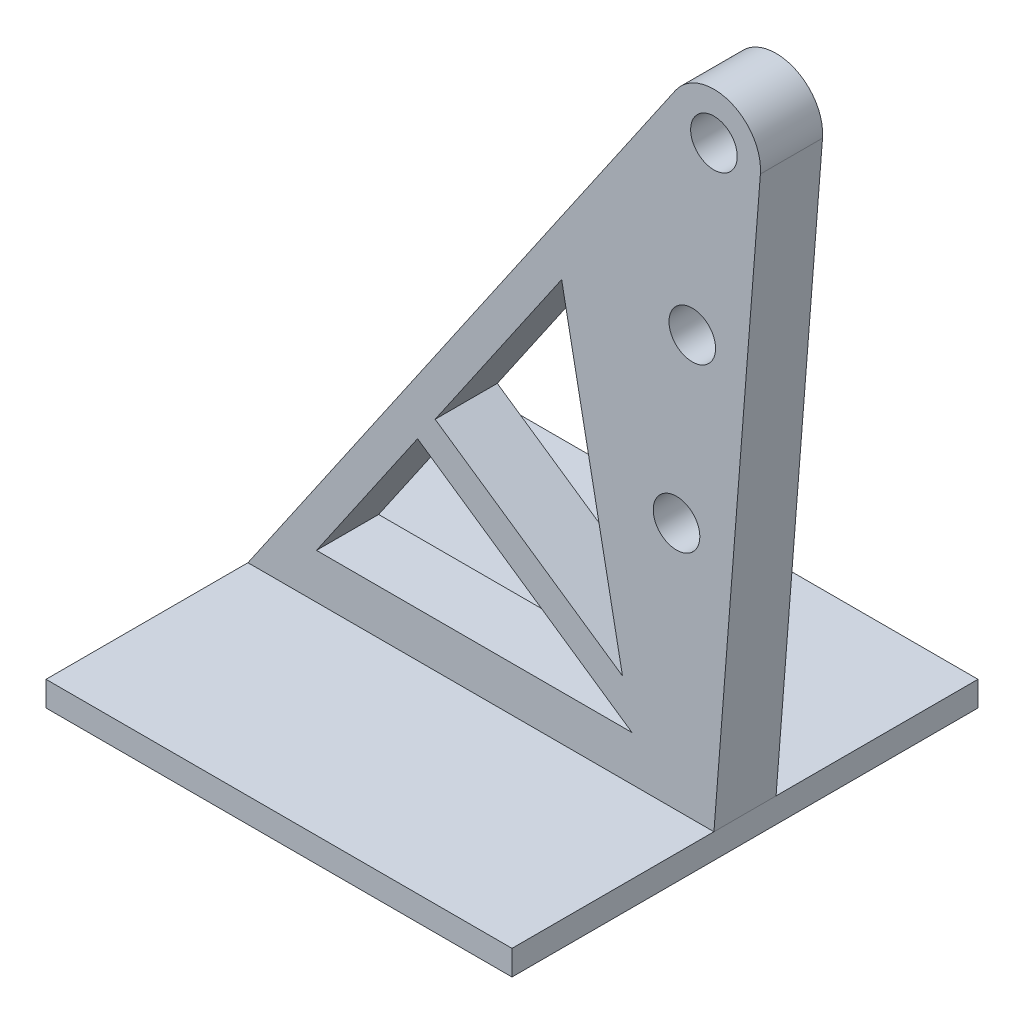
ISO-10303-21;
HEADER;
FILE_DESCRIPTION(('STEP AP214'),'2;1');
FILE_NAME('part.step','',(''),(''),'','','');
FILE_SCHEMA(('AUTOMOTIVE_DESIGN { 1 0 10303 214 1 1 1 1 }'));
ENDSEC;
DATA;
#1=APPLICATION_CONTEXT('core data for automotive mechanical design processes');
#2=APPLICATION_PROTOCOL_DEFINITION('international standard','automotive_design',2000,#1);
#3=PRODUCT_CONTEXT('',#1,'mechanical');
#4=PRODUCT('Part','Part','',(#3));
#5=PRODUCT_RELATED_PRODUCT_CATEGORY('part','',(#4));
#6=PRODUCT_DEFINITION_FORMATION('','',#4);
#7=PRODUCT_DEFINITION_CONTEXT('part definition',#1,'design');
#8=PRODUCT_DEFINITION('design','',#6,#7);
#9=PRODUCT_DEFINITION_SHAPE('','',#8);
#10=(LENGTH_UNIT() NAMED_UNIT(*) SI_UNIT(.MILLI.,.METRE.));
#11=(NAMED_UNIT(*) PLANE_ANGLE_UNIT() SI_UNIT($,.RADIAN.));
#12=(NAMED_UNIT(*) SI_UNIT($,.STERADIAN.) SOLID_ANGLE_UNIT());
#13=UNCERTAINTY_MEASURE_WITH_UNIT(LENGTH_MEASURE(1.E-05),#10,'distance_accuracy_value','');
#14=(GEOMETRIC_REPRESENTATION_CONTEXT(3) GLOBAL_UNCERTAINTY_ASSIGNED_CONTEXT((#13)) GLOBAL_UNIT_ASSIGNED_CONTEXT((#10,
#11,#12)) REPRESENTATION_CONTEXT('',''));
#15=CARTESIAN_POINT('',(0.,0.,0.));
#16=DIRECTION('',(0.,0.,1.));
#17=DIRECTION('',(1.,0.,0.));
#18=AXIS2_PLACEMENT_3D('',#15,#16,#17);
#19=CARTESIAN_POINT('',(0.,0.8,0.));
#20=DIRECTION('',(0.,-1.,0.));
#21=DIRECTION('',(0.,0.,-1.));
#22=AXIS2_PLACEMENT_3D('',#19,#20,#21);
#23=PLANE('',#22);
#24=DIRECTION('',(1.,0.,0.));
#25=VECTOR('',#24,1.);
#26=CARTESIAN_POINT('',(-7.5,0.8,1.));
#27=LINE('',#26,#25);
#28=CARTESIAN_POINT('',(-7.5,0.8,1.));
#29=VERTEX_POINT('',#28);
#30=CARTESIAN_POINT('',(7.5,0.8,1.));
#31=VERTEX_POINT('',#30);
#32=EDGE_CURVE('E211',#29,#31,#27,.T.);
#33=ORIENTED_EDGE('',*,*,#32,.F.);
#34=DIRECTION('',(0.,0.,1.));
#35=VECTOR('',#34,1.);
#36=CARTESIAN_POINT('',(-7.5,0.8,7.5));
#37=LINE('',#36,#35);
#38=CARTESIAN_POINT('',(-7.5,0.8,7.5));
#39=VERTEX_POINT('',#38);
#40=EDGE_CURVE('E260',#29,#39,#37,.T.);
#41=ORIENTED_EDGE('',*,*,#40,.T.);
#42=DIRECTION('',(1.,0.,0.));
#43=VECTOR('',#42,1.);
#44=CARTESIAN_POINT('',(-7.5,0.8,7.5));
#45=LINE('',#44,#43);
#46=CARTESIAN_POINT('',(7.5,0.8,7.5));
#47=VERTEX_POINT('',#46);
#48=EDGE_CURVE('E265',#39,#47,#45,.T.);
#49=ORIENTED_EDGE('',*,*,#48,.T.);
#50=DIRECTION('',(0.,0.,-1.));
#51=VECTOR('',#50,1.);
#52=CARTESIAN_POINT('',(7.5,0.8,7.5));
#53=LINE('',#52,#51);
#54=EDGE_CURVE('E253',#47,#31,#53,.T.);
#55=ORIENTED_EDGE('',*,*,#54,.T.);
#56=EDGE_LOOP('',(#33,#41,#49,#55));
#57=FACE_BOUND('',#56,.T.);
#58=ADVANCED_FACE('F39',(#57),#23,.F.);
#59=CARTESIAN_POINT('',(7.5,0.8,7.5));
#60=DIRECTION('',(-1.,0.,0.));
#61=DIRECTION('',(0.,0.,1.));
#62=AXIS2_PLACEMENT_3D('',#59,#60,#61);
#63=PLANE('',#62);
#64=DIRECTION('',(0.,0.,-1.));
#65=VECTOR('',#64,1.);
#66=CARTESIAN_POINT('',(7.5,0.,7.5));
#67=LINE('',#66,#65);
#68=CARTESIAN_POINT('',(7.5,0.,7.5));
#69=VERTEX_POINT('',#68);
#70=CARTESIAN_POINT('',(7.5,0.,-7.5));
#71=VERTEX_POINT('',#70);
#72=EDGE_CURVE('E252',#69,#71,#67,.T.);
#73=ORIENTED_EDGE('',*,*,#72,.T.);
#74=DIRECTION('',(0.,-1.,0.));
#75=VECTOR('',#74,1.);
#76=CARTESIAN_POINT('',(7.5,0.8,-7.5));
#77=LINE('',#76,#75);
#78=CARTESIAN_POINT('',(7.5,0.8,-7.5));
#79=VERTEX_POINT('',#78);
#80=EDGE_CURVE('E292',#79,#71,#77,.T.);
#81=ORIENTED_EDGE('',*,*,#80,.F.);
#82=CARTESIAN_POINT('',(7.5,0.8,-1.));
#83=VERTEX_POINT('',#82);
#84=EDGE_CURVE('E257',#83,#79,#53,.T.);
#85=ORIENTED_EDGE('',*,*,#84,.F.);
#86=DIRECTION('',(0.,0.,-1.));
#87=VECTOR('',#86,1.);
#88=CARTESIAN_POINT('',(7.5,0.8,1.));
#89=LINE('',#88,#87);
#90=EDGE_CURVE('E248',#31,#83,#89,.T.);
#91=ORIENTED_EDGE('',*,*,#90,.F.);
#92=ORIENTED_EDGE('',*,*,#54,.F.);
#93=DIRECTION('',(0.,-1.,0.));
#94=VECTOR('',#93,1.);
#95=CARTESIAN_POINT('',(7.5,0.8,7.5));
#96=LINE('',#95,#94);
#97=EDGE_CURVE('E268',#47,#69,#96,.T.);
#98=ORIENTED_EDGE('',*,*,#97,.T.);
#99=EDGE_LOOP('',(#73,#81,#85,#91,#92,#98));
#100=FACE_BOUND('',#99,.T.);
#101=ADVANCED_FACE('F41',(#100),#63,.F.);
#102=CARTESIAN_POINT('',(-7.5,0.8,-7.5));
#103=DIRECTION('',(0.,0.,1.));
#104=DIRECTION('',(1.,0.,0.));
#105=AXIS2_PLACEMENT_3D('',#102,#103,#104);
#106=PLANE('',#105);
#107=DIRECTION('',(-1.,0.,0.));
#108=VECTOR('',#107,1.);
#109=CARTESIAN_POINT('',(-7.5,0.,-7.5));
#110=LINE('',#109,#108);
#111=CARTESIAN_POINT('',(-7.5,0.,-7.5));
#112=VERTEX_POINT('',#111);
#113=EDGE_CURVE('E272',#71,#112,#110,.T.);
#114=ORIENTED_EDGE('',*,*,#113,.T.);
#115=DIRECTION('',(0.,-1.,0.));
#116=VECTOR('',#115,1.);
#117=CARTESIAN_POINT('',(-7.5,0.8,-7.5));
#118=LINE('',#117,#116);
#119=CARTESIAN_POINT('',(-7.5,0.8,-7.5));
#120=VERTEX_POINT('',#119);
#121=EDGE_CURVE('E288',#120,#112,#118,.T.);
#122=ORIENTED_EDGE('',*,*,#121,.F.);
#123=DIRECTION('',(-1.,0.,0.));
#124=VECTOR('',#123,1.);
#125=CARTESIAN_POINT('',(-7.5,0.8,-7.5));
#126=LINE('',#125,#124);
#127=EDGE_CURVE('E256',#79,#120,#126,.T.);
#128=ORIENTED_EDGE('',*,*,#127,.F.);
#129=ORIENTED_EDGE('',*,*,#80,.T.);
#130=EDGE_LOOP('',(#114,#122,#128,#129));
#131=FACE_BOUND('',#130,.T.);
#132=ADVANCED_FACE('F350',(#131),#106,.F.);
#133=CARTESIAN_POINT('',(-7.5,0.8,7.5));
#134=DIRECTION('',(1.,0.,0.));
#135=DIRECTION('',(0.,0.,-1.));
#136=AXIS2_PLACEMENT_3D('',#133,#134,#135);
#137=PLANE('',#136);
#138=DIRECTION('',(0.,0.,1.));
#139=VECTOR('',#138,1.);
#140=CARTESIAN_POINT('',(-7.5,0.,7.5));
#141=LINE('',#140,#139);
#142=CARTESIAN_POINT('',(-7.5,0.,7.5));
#143=VERTEX_POINT('',#142);
#144=EDGE_CURVE('E275',#112,#143,#141,.T.);
#145=ORIENTED_EDGE('',*,*,#144,.T.);
#146=DIRECTION('',(0.,-1.,0.));
#147=VECTOR('',#146,1.);
#148=CARTESIAN_POINT('',(-7.5,0.8,7.5));
#149=LINE('',#148,#147);
#150=EDGE_CURVE('E284',#39,#143,#149,.T.);
#151=ORIENTED_EDGE('',*,*,#150,.F.);
#152=ORIENTED_EDGE('',*,*,#40,.F.);
#153=DIRECTION('',(0.,0.,-1.));
#154=VECTOR('',#153,1.);
#155=CARTESIAN_POINT('',(-7.5,0.8,1.));
#156=LINE('',#155,#154);
#157=CARTESIAN_POINT('',(-7.5,0.8,-1.));
#158=VERTEX_POINT('',#157);
#159=EDGE_CURVE('E226',#29,#158,#156,.T.);
#160=ORIENTED_EDGE('',*,*,#159,.T.);
#161=EDGE_CURVE('E261',#120,#158,#37,.T.);
#162=ORIENTED_EDGE('',*,*,#161,.F.);
#163=ORIENTED_EDGE('',*,*,#121,.T.);
#164=EDGE_LOOP('',(#145,#151,#152,#160,#162,#163));
#165=FACE_BOUND('',#164,.T.);
#166=ADVANCED_FACE('F364',(#165),#137,.F.);
#167=CARTESIAN_POINT('',(-7.5,0.8,7.5));
#168=DIRECTION('',(0.,0.,-1.));
#169=DIRECTION('',(-1.,0.,0.));
#170=AXIS2_PLACEMENT_3D('',#167,#168,#169);
#171=PLANE('',#170);
#172=DIRECTION('',(1.,0.,0.));
#173=VECTOR('',#172,1.);
#174=CARTESIAN_POINT('',(-7.5,0.,7.5));
#175=LINE('',#174,#173);
#176=EDGE_CURVE('E278',#143,#69,#175,.T.);
#177=ORIENTED_EDGE('',*,*,#176,.T.);
#178=ORIENTED_EDGE('',*,*,#97,.F.);
#179=ORIENTED_EDGE('',*,*,#48,.F.);
#180=ORIENTED_EDGE('',*,*,#150,.T.);
#181=EDGE_LOOP('',(#177,#178,#179,#180));
#182=FACE_BOUND('',#181,.T.);
#183=ADVANCED_FACE('F356',(#182),#171,.F.);
#184=ORIENTED_EDGE('',*,*,#161,.T.);
#185=DIRECTION('',(1.,0.,0.));
#186=VECTOR('',#185,1.);
#187=CARTESIAN_POINT('',(-7.5,0.8,-1.));
#188=LINE('',#187,#186);
#189=EDGE_CURVE('E210',#158,#83,#188,.T.);
#190=ORIENTED_EDGE('',*,*,#189,.T.);
#191=ORIENTED_EDGE('',*,*,#84,.T.);
#192=ORIENTED_EDGE('',*,*,#127,.T.);
#193=EDGE_LOOP('',(#184,#190,#191,#192));
#194=FACE_BOUND('',#193,.T.);
#195=ADVANCED_FACE('F346',(#194),#23,.F.);
#196=CARTESIAN_POINT('',(0.,0.,0.));
#197=DIRECTION('',(0.,-1.,0.));
#198=DIRECTION('',(0.,0.,-1.));
#199=AXIS2_PLACEMENT_3D('',#196,#197,#198);
#200=PLANE('',#199);
#201=ORIENTED_EDGE('',*,*,#72,.F.);
#202=ORIENTED_EDGE('',*,*,#176,.F.);
#203=ORIENTED_EDGE('',*,*,#144,.F.);
#204=ORIENTED_EDGE('',*,*,#113,.F.);
#205=EDGE_LOOP('',(#201,#202,#203,#204));
#206=FACE_BOUND('',#205,.T.);
#207=ADVANCED_FACE('F355',(#206),#200,.T.);
#208=CARTESIAN_POINT('',(7.5,0.8,1.));
#209=DIRECTION('',(-0.996943571309329,0.078125,0.));
#210=DIRECTION('',(-0.078125,-0.996943571309329,0.));
#211=AXIS2_PLACEMENT_3D('',#208,#209,#210);
#212=PLANE('',#211);
#213=DIRECTION('',(0.078125,0.996943571309329,0.));
#214=VECTOR('',#213,1.);
#215=CARTESIAN_POINT('',(7.5,0.8,-1.));
#216=LINE('',#215,#214);
#217=CARTESIAN_POINT('',(8.99541535696399,19.8828125,-1.));
#218=VERTEX_POINT('',#217);
#219=EDGE_CURVE('E229',#83,#218,#216,.T.);
#220=ORIENTED_EDGE('',*,*,#219,.T.);
#221=DIRECTION('',(0.,0.,-1.));
#222=VECTOR('',#221,1.);
#223=CARTESIAN_POINT('',(8.99541535696399,19.8828125,1.));
#224=LINE('',#223,#222);
#225=CARTESIAN_POINT('',(8.99541535696399,19.8828125,1.));
#226=VERTEX_POINT('',#225);
#227=EDGE_CURVE('E244',#226,#218,#224,.T.);
#228=ORIENTED_EDGE('',*,*,#227,.F.);
#229=DIRECTION('',(0.078125,0.996943571309329,0.));
#230=VECTOR('',#229,1.);
#231=CARTESIAN_POINT('',(7.5,0.8,1.));
#232=LINE('',#231,#230);
#233=EDGE_CURVE('E215',#31,#226,#232,.T.);
#234=ORIENTED_EDGE('',*,*,#233,.F.);
#235=ORIENTED_EDGE('',*,*,#90,.T.);
#236=EDGE_LOOP('',(#220,#228,#234,#235));
#237=FACE_BOUND('',#236,.T.);
#238=ADVANCED_FACE('F362',(#237),#212,.F.);
#239=CARTESIAN_POINT('',(7.5,20.,1.));
#240=DIRECTION('',(0.,0.,-1.));
#241=DIRECTION('',(-1.,0.,0.));
#242=AXIS2_PLACEMENT_3D('',#239,#240,#241);
#243=CYLINDRICAL_SURFACE('',#242,1.5);
#244=CARTESIAN_POINT('',(7.5,20.,-1.));
#245=DIRECTION('',(0.,0.,1.));
#246=DIRECTION('',(1.,0.,0.));
#247=AXIS2_PLACEMENT_3D('',#244,#245,#246);
#248=CIRCLE('',#247,1.5);
#249=CARTESIAN_POINT('',(6.26335299126237,20.8489429755763,-1.));
#250=VERTEX_POINT('',#249);
#251=EDGE_CURVE('E232',#218,#250,#248,.T.);
#252=ORIENTED_EDGE('',*,*,#251,.T.);
#253=DIRECTION('',(0.,0.,-1.));
#254=VECTOR('',#253,1.);
#255=CARTESIAN_POINT('',(6.26335299126237,20.8489429755763,1.));
#256=LINE('',#255,#254);
#257=CARTESIAN_POINT('',(6.26335299126237,20.8489429755763,1.));
#258=VERTEX_POINT('',#257);
#259=EDGE_CURVE('E241',#258,#250,#256,.T.);
#260=ORIENTED_EDGE('',*,*,#259,.F.);
#261=CARTESIAN_POINT('',(7.5,20.,1.));
#262=DIRECTION('',(0.,0.,1.));
#263=DIRECTION('',(1.,0.,0.));
#264=AXIS2_PLACEMENT_3D('',#261,#262,#263);
#265=CIRCLE('',#264,1.5);
#266=EDGE_CURVE('E219',#226,#258,#265,.T.);
#267=ORIENTED_EDGE('',*,*,#266,.F.);
#268=ORIENTED_EDGE('',*,*,#227,.T.);
#269=EDGE_LOOP('',(#252,#260,#267,#268));
#270=FACE_BOUND('',#269,.T.);
#271=ADVANCED_FACE('F338',(#270),#243,.T.);
#272=CARTESIAN_POINT('',(-7.5,0.8,1.));
#273=DIRECTION('',(-0.824431339158416,0.565961983717512,0.));
#274=DIRECTION('',(-0.565961983717512,-0.824431339158416,0.));
#275=AXIS2_PLACEMENT_3D('',#272,#273,#274);
#276=PLANE('',#275);
#277=DIRECTION('',(0.565961983717512,0.824431339158416,0.));
#278=VECTOR('',#277,1.);
#279=CARTESIAN_POINT('',(-7.5,0.8,-1.));
#280=LINE('',#279,#278);
#281=EDGE_CURVE('E216',#158,#250,#280,.T.);
#282=ORIENTED_EDGE('',*,*,#281,.F.);
#283=ORIENTED_EDGE('',*,*,#159,.F.);
#284=DIRECTION('',(0.565961983717512,0.824431339158416,0.));
#285=VECTOR('',#284,1.);
#286=CARTESIAN_POINT('',(-7.5,0.8,1.));
#287=LINE('',#286,#285);
#288=EDGE_CURVE('E222',#29,#258,#287,.T.);
#289=ORIENTED_EDGE('',*,*,#288,.T.);
#290=ORIENTED_EDGE('',*,*,#259,.T.);
#291=EDGE_LOOP('',(#282,#283,#289,#290));
#292=FACE_BOUND('',#291,.T.);
#293=ADVANCED_FACE('F328',(#292),#276,.T.);
#294=CARTESIAN_POINT('',(7.5,20.,1.));
#295=DIRECTION('',(0.,0.,1.));
#296=DIRECTION('',(1.,0.,0.));
#297=AXIS2_PLACEMENT_3D('',#294,#295,#296);
#298=PLANE('',#297);
#299=CARTESIAN_POINT('',(6.295860940672,8.8,1.));
#300=DIRECTION('',(0.,0.,1.));
#301=DIRECTION('',(1.,0.,0.));
#302=AXIS2_PLACEMENT_3D('',#299,#300,#301);
#303=CIRCLE('',#302,0.75);
#304=CARTESIAN_POINT('',(7.045860940672,8.8,1.));
#305=VERTEX_POINT('',#304);
#306=EDGE_CURVE('E174',#305,#305,#303,.T.);
#307=ORIENTED_EDGE('',*,*,#306,.F.);
#308=EDGE_LOOP('',(#307));
#309=FACE_BOUND('',#308,.T.);
#310=DIRECTION('',(-0.824431339158416,0.565961983717512,0.));
#311=VECTOR('',#310,1.);
#312=CARTESIAN_POINT('',(4.86387780825259,2.24733533897935,1.));
#313=LINE('',#312,#311);
#314=CARTESIAN_POINT('',(4.86387780825259,2.24733533897935,1.));
#315=VERTEX_POINT('',#314);
#316=CARTESIAN_POINT('',(-2.03993624416734,6.98671885187808,1.));
#317=VERTEX_POINT('',#316);
#318=EDGE_CURVE('E56',#315,#317,#313,.T.);
#319=ORIENTED_EDGE('',*,*,#318,.F.);
#320=DIRECTION('',(1.,0.,0.));
#321=VECTOR('',#320,1.);
#322=CARTESIAN_POINT('',(-5.29346478821366,2.24733533897935,1.));
#323=LINE('',#322,#321);
#324=CARTESIAN_POINT('',(-5.29346478821366,2.24733533897935,1.));
#325=VERTEX_POINT('',#324);
#326=EDGE_CURVE('E186',#325,#315,#323,.T.);
#327=ORIENTED_EDGE('',*,*,#326,.F.);
#328=DIRECTION('',(-0.565961983717512,-0.824431339158416,0.));
#329=VECTOR('',#328,1.);
#330=CARTESIAN_POINT('',(-2.03993624416734,6.98671885187808,1.));
#331=LINE('',#330,#329);
#332=EDGE_CURVE('E182',#317,#325,#331,.T.);
#333=ORIENTED_EDGE('',*,*,#332,.F.);
#334=EDGE_LOOP('',(#319,#327,#333));
#335=FACE_BOUND('',#334,.T.);
#336=DIRECTION('',(-0.565961983717512,-0.824431339158416,0.));
#337=VECTOR('',#336,1.);
#338=CARTESIAN_POINT('',(2.59799305155808,13.7427455289375,1.));
#339=LINE('',#338,#337);
#340=CARTESIAN_POINT('',(2.59799305155808,13.7427455289375,1.));
#341=VERTEX_POINT('',#340);
#342=CARTESIAN_POINT('',(-1.47397426044983,7.8111501910365,1.));
#343=VERTEX_POINT('',#342);
#344=EDGE_CURVE('E64',#341,#343,#339,.T.);
#345=ORIENTED_EDGE('',*,*,#344,.F.);
#346=DIRECTION('',(-0.190874155677059,0.981614515323897,0.));
#347=VECTOR('',#346,1.);
#348=CARTESIAN_POINT('',(4.55635786666214,3.67140128651319,1.));
#349=LINE('',#348,#347);
#350=CARTESIAN_POINT('',(4.55635786666214,3.67140128651319,1.));
#351=VERTEX_POINT('',#350);
#352=EDGE_CURVE('E149',#351,#341,#349,.T.);
#353=ORIENTED_EDGE('',*,*,#352,.F.);
#354=DIRECTION('',(0.824431339158416,-0.565961983717512,0.));
#355=VECTOR('',#354,1.);
#356=CARTESIAN_POINT('',(-1.47397426044983,7.81115019103649,1.));
#357=LINE('',#356,#355);
#358=EDGE_CURVE('E159',#343,#351,#357,.T.);
#359=ORIENTED_EDGE('',*,*,#358,.F.);
#360=EDGE_LOOP('',(#345,#353,#359));
#361=FACE_BOUND('',#360,.T.);
#362=CARTESIAN_POINT('',(6.80335890635377,14.3,1.));
#363=DIRECTION('',(0.,0.,1.));
#364=DIRECTION('',(1.,0.,0.));
#365=AXIS2_PLACEMENT_3D('',#362,#363,#364);
#366=CIRCLE('',#365,0.75);
#367=CARTESIAN_POINT('',(7.55335890635377,14.3,1.));
#368=VERTEX_POINT('',#367);
#369=EDGE_CURVE('E178',#368,#368,#366,.T.);
#370=ORIENTED_EDGE('',*,*,#369,.F.);
#371=EDGE_LOOP('',(#370));
#372=FACE_BOUND('',#371,.T.);
#373=CARTESIAN_POINT('',(7.5,20.,1.));
#374=DIRECTION('',(0.,0.,1.));
#375=DIRECTION('',(1.,0.,0.));
#376=AXIS2_PLACEMENT_3D('',#373,#374,#375);
#377=CIRCLE('',#376,0.75);
#378=CARTESIAN_POINT('',(8.25,20.,1.));
#379=VERTEX_POINT('',#378);
#380=EDGE_CURVE('E206',#379,#379,#377,.T.);
#381=ORIENTED_EDGE('',*,*,#380,.F.);
#382=EDGE_LOOP('',(#381));
#383=FACE_BOUND('',#382,.T.);
#384=ORIENTED_EDGE('',*,*,#32,.T.);
#385=ORIENTED_EDGE('',*,*,#233,.T.);
#386=ORIENTED_EDGE('',*,*,#266,.T.);
#387=ORIENTED_EDGE('',*,*,#288,.F.);
#388=EDGE_LOOP('',(#384,#385,#386,#387));
#389=FACE_BOUND('',#388,.T.);
#390=ADVANCED_FACE('F164',(#309,#335,#361,#372,#383,#389),#298,.T.);
#391=CARTESIAN_POINT('',(7.5,20.,-1.));
#392=DIRECTION('',(0.,0.,1.));
#393=DIRECTION('',(1.,0.,0.));
#394=AXIS2_PLACEMENT_3D('',#391,#392,#393);
#395=PLANE('',#394);
#396=CARTESIAN_POINT('',(6.295860940672,8.8,-1.));
#397=DIRECTION('',(0.,0.,1.));
#398=DIRECTION('',(1.,0.,0.));
#399=AXIS2_PLACEMENT_3D('',#396,#397,#398);
#400=CIRCLE('',#399,0.75);
#401=CARTESIAN_POINT('',(7.045860940672,8.8,-1.));
#402=VERTEX_POINT('',#401);
#403=EDGE_CURVE('E43',#402,#402,#400,.T.);
#404=ORIENTED_EDGE('',*,*,#403,.T.);
#405=EDGE_LOOP('',(#404));
#406=FACE_BOUND('',#405,.T.);
#407=DIRECTION('',(1.,0.,0.));
#408=VECTOR('',#407,1.);
#409=CARTESIAN_POINT('',(7.5,2.24733533897934,-1.));
#410=LINE('',#409,#408);
#411=CARTESIAN_POINT('',(-5.29346478821366,2.24733533897935,-1.));
#412=VERTEX_POINT('',#411);
#413=CARTESIAN_POINT('',(4.86387780825259,2.24733533897935,-1.));
#414=VERTEX_POINT('',#413);
#415=EDGE_CURVE('E49',#412,#414,#410,.T.);
#416=ORIENTED_EDGE('',*,*,#415,.T.);
#417=DIRECTION('',(-0.824431339158416,0.565961983717512,0.));
#418=VECTOR('',#417,1.);
#419=CARTESIAN_POINT('',(-1.62772057458813,6.70373786001932,-1.));
#420=LINE('',#419,#418);
#421=CARTESIAN_POINT('',(-2.03993624416734,6.98671885187808,-1.));
#422=VERTEX_POINT('',#421);
#423=EDGE_CURVE('E11',#414,#422,#420,.T.);
#424=ORIENTED_EDGE('',*,*,#423,.T.);
#425=DIRECTION('',(-0.565961983717512,-0.824431339158416,0.));
#426=VECTOR('',#425,1.);
#427=CARTESIAN_POINT('',(7.08778433042079,20.2829809918588,-1.));
#428=LINE('',#427,#426);
#429=EDGE_CURVE('E308',#422,#412,#428,.T.);
#430=ORIENTED_EDGE('',*,*,#429,.T.);
#431=EDGE_LOOP('',(#416,#424,#430));
#432=FACE_BOUND('',#431,.T.);
#433=DIRECTION('',(-0.190874155677059,0.981614515323897,0.));
#434=VECTOR('',#433,1.);
#435=CARTESIAN_POINT('',(1.60419809864045,18.8535660461481,-1.));
#436=LINE('',#435,#434);
#437=CARTESIAN_POINT('',(4.55635786666214,3.67140128651319,-1.));
#438=VERTEX_POINT('',#437);
#439=CARTESIAN_POINT('',(2.59799305155808,13.7427455289375,-1.));
#440=VERTEX_POINT('',#439);
#441=EDGE_CURVE('E151',#438,#440,#436,.T.);
#442=ORIENTED_EDGE('',*,*,#441,.T.);
#443=DIRECTION('',(-0.565961983717512,-0.824431339158416,0.));
#444=VECTOR('',#443,1.);
#445=CARTESIAN_POINT('',(7.08778433042079,20.2829809918588,-1.));
#446=LINE('',#445,#444);
#447=CARTESIAN_POINT('',(-1.47397426044983,7.81115019103649,-1.));
#448=VERTEX_POINT('',#447);
#449=EDGE_CURVE('E304',#440,#448,#446,.T.);
#450=ORIENTED_EDGE('',*,*,#449,.T.);
#451=DIRECTION('',(0.824431339158416,-0.565961983717512,0.));
#452=VECTOR('',#451,1.);
#453=CARTESIAN_POINT('',(-1.06175859087062,7.52816919917774,-1.));
#454=LINE('',#453,#452);
#455=EDGE_CURVE('E296',#448,#438,#454,.T.);
#456=ORIENTED_EDGE('',*,*,#455,.T.);
#457=EDGE_LOOP('',(#442,#450,#456));
#458=FACE_BOUND('',#457,.T.);
#459=CARTESIAN_POINT('',(6.80335890635377,14.3,-1.));
#460=DIRECTION('',(0.,0.,1.));
#461=DIRECTION('',(1.,0.,0.));
#462=AXIS2_PLACEMENT_3D('',#459,#460,#461);
#463=CIRCLE('',#462,0.75);
#464=CARTESIAN_POINT('',(7.55335890635377,14.3,-1.));
#465=VERTEX_POINT('',#464);
#466=EDGE_CURVE('E201',#465,#465,#463,.T.);
#467=ORIENTED_EDGE('',*,*,#466,.T.);
#468=EDGE_LOOP('',(#467));
#469=FACE_BOUND('',#468,.T.);
#470=CARTESIAN_POINT('',(7.5,20.,-1.));
#471=DIRECTION('',(0.,0.,-1.));
#472=DIRECTION('',(-1.,0.,0.));
#473=AXIS2_PLACEMENT_3D('',#470,#471,#472);
#474=CIRCLE('',#473,0.75);
#475=CARTESIAN_POINT('',(6.75,20.,-1.));
#476=VERTEX_POINT('',#475);
#477=EDGE_CURVE('E202',#476,#476,#474,.T.);
#478=ORIENTED_EDGE('',*,*,#477,.F.);
#479=EDGE_LOOP('',(#478));
#480=FACE_BOUND('',#479,.T.);
#481=ORIENTED_EDGE('',*,*,#189,.F.);
#482=ORIENTED_EDGE('',*,*,#281,.T.);
#483=ORIENTED_EDGE('',*,*,#251,.F.);
#484=ORIENTED_EDGE('',*,*,#219,.F.);
#485=EDGE_LOOP('',(#481,#482,#483,#484));
#486=FACE_BOUND('',#485,.T.);
#487=ADVANCED_FACE('F316',(#406,#432,#458,#469,#480,#486),#395,.F.);
#488=CARTESIAN_POINT('',(7.5,20.,7.5));
#489=DIRECTION('',(0.,0.,-1.));
#490=DIRECTION('',(-1.,0.,0.));
#491=AXIS2_PLACEMENT_3D('',#488,#489,#490);
#492=CYLINDRICAL_SURFACE('',#491,0.75);
#493=ORIENTED_EDGE('',*,*,#380,.T.);
#494=EDGE_LOOP('',(#493));
#495=FACE_BOUND('',#494,.T.);
#496=ORIENTED_EDGE('',*,*,#477,.T.);
#497=EDGE_LOOP('',(#496));
#498=FACE_BOUND('',#497,.T.);
#499=ADVANCED_FACE('F335',(#495,#498),#492,.F.);
#500=CARTESIAN_POINT('',(6.80335890635377,14.3,-69.));
#501=DIRECTION('',(0.,0.,1.));
#502=DIRECTION('',(1.,0.,0.));
#503=AXIS2_PLACEMENT_3D('',#500,#501,#502);
#504=CYLINDRICAL_SURFACE('',#503,0.75);
#505=ORIENTED_EDGE('',*,*,#369,.T.);
#506=EDGE_LOOP('',(#505));
#507=FACE_BOUND('',#506,.T.);
#508=ORIENTED_EDGE('',*,*,#466,.F.);
#509=EDGE_LOOP('',(#508));
#510=FACE_BOUND('',#509,.T.);
#511=ADVANCED_FACE('F409',(#507,#510),#504,.F.);
#512=CARTESIAN_POINT('',(2.59799305155808,13.7427455289375,-69.));
#513=DIRECTION('',(-0.824431339158416,0.565961983717512,0.));
#514=DIRECTION('',(-0.565961983717512,-0.824431339158416,0.));
#515=AXIS2_PLACEMENT_3D('',#512,#513,#514);
#516=PLANE('',#515);
#517=DIRECTION('',(0.,0.,1.));
#518=VECTOR('',#517,1.);
#519=CARTESIAN_POINT('',(2.59799305155808,13.7427455289375,-69.));
#520=LINE('',#519,#518);
#521=EDGE_CURVE('E155',#440,#341,#520,.T.);
#522=ORIENTED_EDGE('',*,*,#521,.T.);
#523=ORIENTED_EDGE('',*,*,#344,.T.);
#524=DIRECTION('',(0.,0.,1.));
#525=VECTOR('',#524,1.);
#526=CARTESIAN_POINT('',(-1.47397426044983,7.81115019103649,-69.));
#527=LINE('',#526,#525);
#528=EDGE_CURVE('E156',#448,#343,#527,.T.);
#529=ORIENTED_EDGE('',*,*,#528,.F.);
#530=ORIENTED_EDGE('',*,*,#449,.F.);
#531=EDGE_LOOP('',(#522,#523,#529,#530));
#532=FACE_BOUND('',#531,.T.);
#533=ADVANCED_FACE('F403',(#532),#516,.F.);
#534=CARTESIAN_POINT('',(4.55635786666214,3.67140128651319,-69.));
#535=DIRECTION('',(0.981614515323897,0.190874155677059,0.));
#536=DIRECTION('',(-0.190874155677059,0.981614515323897,0.));
#537=AXIS2_PLACEMENT_3D('',#534,#535,#536);
#538=PLANE('',#537);
#539=DIRECTION('',(0.,0.,1.));
#540=VECTOR('',#539,1.);
#541=CARTESIAN_POINT('',(4.55635786666214,3.67140128651319,-69.));
#542=LINE('',#541,#540);
#543=EDGE_CURVE('E144',#438,#351,#542,.T.);
#544=ORIENTED_EDGE('',*,*,#543,.T.);
#545=ORIENTED_EDGE('',*,*,#352,.T.);
#546=ORIENTED_EDGE('',*,*,#521,.F.);
#547=ORIENTED_EDGE('',*,*,#441,.F.);
#548=EDGE_LOOP('',(#544,#545,#546,#547));
#549=FACE_BOUND('',#548,.T.);
#550=ADVANCED_FACE('F146',(#549),#538,.F.);
#551=CARTESIAN_POINT('',(-1.47397426044983,7.81115019103649,-69.));
#552=DIRECTION('',(-0.565961983717512,-0.824431339158416,0.));
#553=DIRECTION('',(0.824431339158416,-0.565961983717512,0.));
#554=AXIS2_PLACEMENT_3D('',#551,#552,#553);
#555=PLANE('',#554);
#556=ORIENTED_EDGE('',*,*,#528,.T.);
#557=ORIENTED_EDGE('',*,*,#358,.T.);
#558=ORIENTED_EDGE('',*,*,#543,.F.);
#559=ORIENTED_EDGE('',*,*,#455,.F.);
#560=EDGE_LOOP('',(#556,#557,#558,#559));
#561=FACE_BOUND('',#560,.T.);
#562=ADVANCED_FACE('F160',(#561),#555,.F.);
#563=CARTESIAN_POINT('',(4.86387780825259,2.24733533897935,-69.));
#564=DIRECTION('',(0.565961983717512,0.824431339158416,0.));
#565=DIRECTION('',(-0.824431339158416,0.565961983717512,0.));
#566=AXIS2_PLACEMENT_3D('',#563,#564,#565);
#567=PLANE('',#566);
#568=DIRECTION('',(0.,0.,1.));
#569=VECTOR('',#568,1.);
#570=CARTESIAN_POINT('',(4.86387780825259,2.24733533897935,-69.));
#571=LINE('',#570,#569);
#572=EDGE_CURVE('E179',#414,#315,#571,.T.);
#573=ORIENTED_EDGE('',*,*,#572,.T.);
#574=ORIENTED_EDGE('',*,*,#318,.T.);
#575=DIRECTION('',(0.,0.,1.));
#576=VECTOR('',#575,1.);
#577=CARTESIAN_POINT('',(-2.03993624416734,6.98671885187808,-69.));
#578=LINE('',#577,#576);
#579=EDGE_CURVE('E190',#422,#317,#578,.T.);
#580=ORIENTED_EDGE('',*,*,#579,.F.);
#581=ORIENTED_EDGE('',*,*,#423,.F.);
#582=EDGE_LOOP('',(#573,#574,#580,#581));
#583=FACE_BOUND('',#582,.T.);
#584=ADVANCED_FACE('F322',(#583),#567,.F.);
#585=CARTESIAN_POINT('',(-5.29346478821366,2.24733533897935,-69.));
#586=DIRECTION('',(0.,-1.,0.));
#587=DIRECTION('',(0.,0.,-1.));
#588=AXIS2_PLACEMENT_3D('',#585,#586,#587);
#589=PLANE('',#588);
#590=DIRECTION('',(0.,0.,1.));
#591=VECTOR('',#590,1.);
#592=CARTESIAN_POINT('',(-5.29346478821366,2.24733533897935,-69.));
#593=LINE('',#592,#591);
#594=EDGE_CURVE('E193',#412,#325,#593,.T.);
#595=ORIENTED_EDGE('',*,*,#594,.T.);
#596=ORIENTED_EDGE('',*,*,#326,.T.);
#597=ORIENTED_EDGE('',*,*,#572,.F.);
#598=ORIENTED_EDGE('',*,*,#415,.F.);
#599=EDGE_LOOP('',(#595,#596,#597,#598));
#600=FACE_BOUND('',#599,.T.);
#601=ADVANCED_FACE('F320',(#600),#589,.F.);
#602=CARTESIAN_POINT('',(-2.03993624416734,6.98671885187808,-69.));
#603=DIRECTION('',(-0.824431339158416,0.565961983717512,0.));
#604=DIRECTION('',(-0.565961983717512,-0.824431339158416,0.));
#605=AXIS2_PLACEMENT_3D('',#602,#603,#604);
#606=PLANE('',#605);
#607=ORIENTED_EDGE('',*,*,#579,.T.);
#608=ORIENTED_EDGE('',*,*,#332,.T.);
#609=ORIENTED_EDGE('',*,*,#594,.F.);
#610=ORIENTED_EDGE('',*,*,#429,.F.);
#611=EDGE_LOOP('',(#607,#608,#609,#610));
#612=FACE_BOUND('',#611,.T.);
#613=ADVANCED_FACE('F325',(#612),#606,.F.);
#614=CARTESIAN_POINT('',(6.295860940672,8.8,-69.));
#615=DIRECTION('',(0.,0.,1.));
#616=DIRECTION('',(1.,0.,0.));
#617=AXIS2_PLACEMENT_3D('',#614,#615,#616);
#618=CYLINDRICAL_SURFACE('',#617,0.75);
#619=ORIENTED_EDGE('',*,*,#306,.T.);
#620=EDGE_LOOP('',(#619));
#621=FACE_BOUND('',#620,.T.);
#622=ORIENTED_EDGE('',*,*,#403,.F.);
#623=EDGE_LOOP('',(#622));
#624=FACE_BOUND('',#623,.T.);
#625=ADVANCED_FACE('F393',(#621,#624),#618,.F.);
#626=CLOSED_SHELL('',(#58,#101,#132,#166,#183,#195,#207,#238,#271,#293,#390,#487,#499,#511,#533,
#550,#562,#584,#601,#613,#625));
#627=MANIFOLD_SOLID_BREP('B2',#626);
#628=ADVANCED_BREP_SHAPE_REPRESENTATION('',(#18,#627),#14);
#629=SHAPE_DEFINITION_REPRESENTATION(#9,#628);
ENDSEC;
END-ISO-10303-21;
